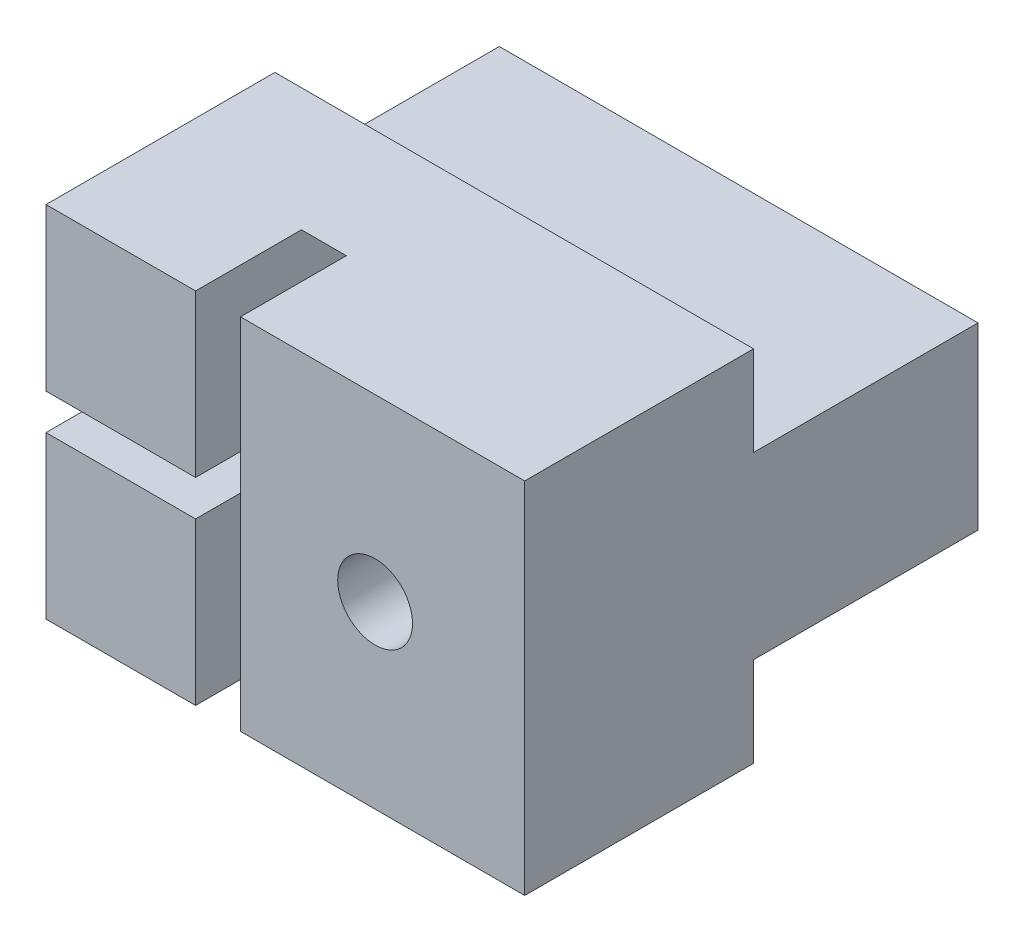
ISO-10303-21;
HEADER;
FILE_DESCRIPTION(('STEP AP214'),'2;1');
FILE_NAME('part.step','',(''),(''),'','','');
FILE_SCHEMA(('AUTOMOTIVE_DESIGN { 1 0 10303 214 1 1 1 1 }'));
ENDSEC;
DATA;
#1=APPLICATION_CONTEXT('core data for automotive mechanical design processes');
#2=APPLICATION_PROTOCOL_DEFINITION('international standard','automotive_design',2000,#1);
#3=PRODUCT_CONTEXT('',#1,'mechanical');
#4=PRODUCT('Part','Part','',(#3));
#5=PRODUCT_RELATED_PRODUCT_CATEGORY('part','',(#4));
#6=PRODUCT_DEFINITION_FORMATION('','',#4);
#7=PRODUCT_DEFINITION_CONTEXT('part definition',#1,'design');
#8=PRODUCT_DEFINITION('design','',#6,#7);
#9=PRODUCT_DEFINITION_SHAPE('','',#8);
#10=(LENGTH_UNIT() NAMED_UNIT(*) SI_UNIT(.MILLI.,.METRE.));
#11=(NAMED_UNIT(*) PLANE_ANGLE_UNIT() SI_UNIT($,.RADIAN.));
#12=(NAMED_UNIT(*) SI_UNIT($,.STERADIAN.) SOLID_ANGLE_UNIT());
#13=UNCERTAINTY_MEASURE_WITH_UNIT(LENGTH_MEASURE(1.E-05),#10,'distance_accuracy_value','');
#14=(GEOMETRIC_REPRESENTATION_CONTEXT(3) GLOBAL_UNCERTAINTY_ASSIGNED_CONTEXT((#13)) GLOBAL_UNIT_ASSIGNED_CONTEXT((#10,
#11,#12)) REPRESENTATION_CONTEXT('',''));
#15=CARTESIAN_POINT('',(0.,0.,0.));
#16=DIRECTION('',(0.,0.,1.));
#17=DIRECTION('',(1.,0.,0.));
#18=AXIS2_PLACEMENT_3D('',#15,#16,#17);
#19=CARTESIAN_POINT('',(0.,0.,0.));
#20=DIRECTION('',(0.,0.,-1.));
#21=DIRECTION('',(-1.,0.,0.));
#22=AXIS2_PLACEMENT_3D('',#19,#20,#21);
#23=PLANE('',#22);
#24=DIRECTION('',(1.,0.,0.));
#25=VECTOR('',#24,1.);
#26=CARTESIAN_POINT('',(-5.59969369608177,28.,0.));
#27=LINE('',#26,#25);
#28=CARTESIAN_POINT('',(-21.5996936960818,28.,0.));
#29=VERTEX_POINT('',#28);
#30=CARTESIAN_POINT('',(-5.59969369608177,28.,0.));
#31=VERTEX_POINT('',#30);
#32=EDGE_CURVE('E174',#29,#31,#27,.T.);
#33=ORIENTED_EDGE('',*,*,#32,.F.);
#34=DIRECTION('',(0.,-1.,0.));
#35=VECTOR('',#34,1.);
#36=CARTESIAN_POINT('',(-21.5996936960818,19.,0.));
#37=LINE('',#36,#35);
#38=CARTESIAN_POINT('',(-21.5996936960818,31.,0.));
#39=VERTEX_POINT('',#38);
#40=EDGE_CURVE('E245',#39,#29,#37,.T.);
#41=ORIENTED_EDGE('',*,*,#40,.F.);
#42=DIRECTION('',(-1.,0.,0.));
#43=VECTOR('',#42,1.);
#44=CARTESIAN_POINT('',(-21.5996936960818,31.,0.));
#45=LINE('',#44,#43);
#46=CARTESIAN_POINT('',(-5.59969369608177,31.,0.));
#47=VERTEX_POINT('',#46);
#48=EDGE_CURVE('E234',#47,#39,#45,.T.);
#49=ORIENTED_EDGE('',*,*,#48,.F.);
#50=DIRECTION('',(0.,1.,0.));
#51=VECTOR('',#50,1.);
#52=CARTESIAN_POINT('',(-5.59969369608177,19.,0.));
#53=LINE('',#52,#51);
#54=EDGE_CURVE('E56',#31,#47,#53,.T.);
#55=ORIENTED_EDGE('',*,*,#54,.F.);
#56=EDGE_LOOP('',(#33,#41,#49,#55));
#57=FACE_BOUND('',#56,.T.);
#58=ADVANCED_FACE('F41',(#57),#23,.T.);
#59=CARTESIAN_POINT('',(-21.5996936960818,19.,27.65));
#60=DIRECTION('',(0.,1.,0.));
#61=DIRECTION('',(0.,0.,1.));
#62=AXIS2_PLACEMENT_3D('',#59,#60,#61);
#63=PLANE('',#62);
#64=DIRECTION('',(0.,0.,1.));
#65=VECTOR('',#64,1.);
#66=CARTESIAN_POINT('',(-15.0996936960818,19.,27.65));
#67=LINE('',#66,#65);
#68=CARTESIAN_POINT('',(-15.0996936960818,19.,4.11123412892984));
#69=VERTEX_POINT('',#68);
#70=CARTESIAN_POINT('',(-15.0996936960818,19.,7.65));
#71=VERTEX_POINT('',#70);
#72=EDGE_CURVE('E201',#69,#71,#67,.T.);
#73=ORIENTED_EDGE('',*,*,#72,.F.);
#74=DIRECTION('',(-1.,0.,0.));
#75=VECTOR('',#74,1.);
#76=CARTESIAN_POINT('',(-15.0996936960818,19.,4.11123412892984));
#77=LINE('',#76,#75);
#78=CARTESIAN_POINT('',(-16.5996936960818,19.,4.11123412892984));
#79=VERTEX_POINT('',#78);
#80=EDGE_CURVE('E203',#69,#79,#77,.T.);
#81=ORIENTED_EDGE('',*,*,#80,.T.);
#82=DIRECTION('',(0.,0.,1.));
#83=VECTOR('',#82,1.);
#84=CARTESIAN_POINT('',(-16.5996936960818,19.,27.65));
#85=LINE('',#84,#83);
#86=CARTESIAN_POINT('',(-16.5996936960818,19.,7.65));
#87=VERTEX_POINT('',#86);
#88=EDGE_CURVE('E192',#79,#87,#85,.T.);
#89=ORIENTED_EDGE('',*,*,#88,.T.);
#90=DIRECTION('',(1.,0.,0.));
#91=VECTOR('',#90,1.);
#92=CARTESIAN_POINT('',(-21.5996936960818,19.,7.65));
#93=LINE('',#92,#91);
#94=CARTESIAN_POINT('',(-21.5996936960818,19.,7.65));
#95=VERTEX_POINT('',#94);
#96=EDGE_CURVE('E252',#95,#87,#93,.T.);
#97=ORIENTED_EDGE('',*,*,#96,.F.);
#98=DIRECTION('',(0.,0.,-1.));
#99=VECTOR('',#98,1.);
#100=CARTESIAN_POINT('',(-21.5996936960818,19.,27.65));
#101=LINE('',#100,#99);
#102=CARTESIAN_POINT('',(-21.5996936960818,19.,0.));
#103=VERTEX_POINT('',#102);
#104=EDGE_CURVE('E244',#95,#103,#101,.T.);
#105=ORIENTED_EDGE('',*,*,#104,.T.);
#106=DIRECTION('',(1.,0.,0.));
#107=VECTOR('',#106,1.);
#108=CARTESIAN_POINT('',(-21.5996936960818,19.,0.));
#109=LINE('',#108,#107);
#110=CARTESIAN_POINT('',(-5.59969369608177,19.,0.));
#111=VERTEX_POINT('',#110);
#112=EDGE_CURVE('E240',#103,#111,#109,.T.);
#113=ORIENTED_EDGE('',*,*,#112,.T.);
#114=DIRECTION('',(0.,0.,-1.));
#115=VECTOR('',#114,1.);
#116=CARTESIAN_POINT('',(-5.59969369608177,19.,27.65));
#117=LINE('',#116,#115);
#118=CARTESIAN_POINT('',(-5.59969369608177,19.,7.65));
#119=VERTEX_POINT('',#118);
#120=EDGE_CURVE('E243',#119,#111,#117,.T.);
#121=ORIENTED_EDGE('',*,*,#120,.F.);
#122=EDGE_CURVE('E255',#71,#119,#93,.T.);
#123=ORIENTED_EDGE('',*,*,#122,.F.);
#124=EDGE_LOOP('',(#73,#81,#89,#97,#105,#113,#121,#123));
#125=FACE_BOUND('',#124,.T.);
#126=ADVANCED_FACE('F278',(#125),#63,.F.);
#127=CARTESIAN_POINT('',(-21.5996936960818,31.,27.65));
#128=DIRECTION('',(0.,-1.,0.));
#129=DIRECTION('',(0.,0.,-1.));
#130=AXIS2_PLACEMENT_3D('',#127,#128,#129);
#131=PLANE('',#130);
#132=DIRECTION('',(0.,0.,-1.));
#133=VECTOR('',#132,1.);
#134=CARTESIAN_POINT('',(-15.0996936960818,31.,27.65));
#135=LINE('',#134,#133);
#136=CARTESIAN_POINT('',(-15.0996936960818,31.,7.65));
#137=VERTEX_POINT('',#136);
#138=CARTESIAN_POINT('',(-15.0996936960818,31.,4.11123412892984));
#139=VERTEX_POINT('',#138);
#140=EDGE_CURVE('E199',#137,#139,#135,.T.);
#141=ORIENTED_EDGE('',*,*,#140,.F.);
#142=DIRECTION('',(-1.,0.,0.));
#143=VECTOR('',#142,1.);
#144=CARTESIAN_POINT('',(-21.5996936960818,31.,7.65));
#145=LINE('',#144,#143);
#146=CARTESIAN_POINT('',(-5.59969369608177,31.,7.65));
#147=VERTEX_POINT('',#146);
#148=EDGE_CURVE('E260',#147,#137,#145,.T.);
#149=ORIENTED_EDGE('',*,*,#148,.F.);
#150=DIRECTION('',(0.,0.,-1.));
#151=VECTOR('',#150,1.);
#152=CARTESIAN_POINT('',(-5.59969369608177,31.,27.65));
#153=LINE('',#152,#151);
#154=EDGE_CURVE('E238',#147,#47,#153,.T.);
#155=ORIENTED_EDGE('',*,*,#154,.T.);
#156=ORIENTED_EDGE('',*,*,#48,.T.);
#157=DIRECTION('',(0.,0.,-1.));
#158=VECTOR('',#157,1.);
#159=CARTESIAN_POINT('',(-21.5996936960818,31.,27.65));
#160=LINE('',#159,#158);
#161=CARTESIAN_POINT('',(-21.5996936960818,31.,7.65));
#162=VERTEX_POINT('',#161);
#163=EDGE_CURVE('E227',#162,#39,#160,.T.);
#164=ORIENTED_EDGE('',*,*,#163,.F.);
#165=CARTESIAN_POINT('',(-16.5996936960818,31.,7.65));
#166=VERTEX_POINT('',#165);
#167=EDGE_CURVE('E237',#166,#162,#145,.T.);
#168=ORIENTED_EDGE('',*,*,#167,.F.);
#169=DIRECTION('',(0.,0.,-1.));
#170=VECTOR('',#169,1.);
#171=CARTESIAN_POINT('',(-16.5996936960818,31.,27.65));
#172=LINE('',#171,#170);
#173=CARTESIAN_POINT('',(-16.5996936960818,31.,4.11123412892984));
#174=VERTEX_POINT('',#173);
#175=EDGE_CURVE('E196',#166,#174,#172,.T.);
#176=ORIENTED_EDGE('',*,*,#175,.T.);
#177=DIRECTION('',(-1.,0.,0.));
#178=VECTOR('',#177,1.);
#179=CARTESIAN_POINT('',(-15.0996936960818,31.,4.11123412892984));
#180=LINE('',#179,#178);
#181=EDGE_CURVE('E11',#174,#139,#180,.F.);
#182=ORIENTED_EDGE('',*,*,#181,.T.);
#183=EDGE_LOOP('',(#141,#149,#155,#156,#164,#168,#176,#182));
#184=FACE_BOUND('',#183,.T.);
#185=ADVANCED_FACE('F281',(#184),#131,.F.);
#186=CARTESIAN_POINT('',(-94.7383382518,25.35,7.65));
#187=DIRECTION('',(0.,0.,1.));
#188=DIRECTION('',(0.,1.,0.));
#189=AXIS2_PLACEMENT_3D('',#186,#187,#188);
#190=PLANE('',#189);
#191=CARTESIAN_POINT('',(-10.5996936960818,25.,7.65));
#192=DIRECTION('',(0.,0.,-1.));
#193=DIRECTION('',(-1.,0.,0.));
#194=AXIS2_PLACEMENT_3D('',#191,#192,#193);
#195=CIRCLE('',#194,1.25);
#196=CARTESIAN_POINT('',(-11.8496936960818,25.,7.65));
#197=VERTEX_POINT('',#196);
#198=EDGE_CURVE('E365',#197,#197,#195,.T.);
#199=ORIENTED_EDGE('',*,*,#198,.T.);
#200=EDGE_LOOP('',(#199));
#201=FACE_BOUND('',#200,.T.);
#202=ORIENTED_EDGE('',*,*,#148,.T.);
#203=DIRECTION('',(0.,-1.,0.));
#204=VECTOR('',#203,1.);
#205=CARTESIAN_POINT('',(-15.0996936960818,25.35,7.65));
#206=LINE('',#205,#204);
#207=EDGE_CURVE('E49',#137,#71,#206,.T.);
#208=ORIENTED_EDGE('',*,*,#207,.T.);
#209=ORIENTED_EDGE('',*,*,#122,.T.);
#210=DIRECTION('',(0.,1.,0.));
#211=VECTOR('',#210,1.);
#212=CARTESIAN_POINT('',(-5.59969369608177,19.,7.65));
#213=LINE('',#212,#211);
#214=EDGE_CURVE('E249',#119,#147,#213,.T.);
#215=ORIENTED_EDGE('',*,*,#214,.T.);
#216=EDGE_LOOP('',(#202,#208,#209,#215));
#217=FACE_BOUND('',#216,.T.);
#218=ADVANCED_FACE('F271',(#201,#217),#190,.T.);
#219=DIRECTION('',(0.,-1.,0.));
#220=VECTOR('',#219,1.);
#221=CARTESIAN_POINT('',(-16.5996936960818,25.35,7.65));
#222=LINE('',#221,#220);
#223=CARTESIAN_POINT('',(-16.5996936960818,25.6,7.65));
#224=VERTEX_POINT('',#223);
#225=EDGE_CURVE('E193',#166,#224,#222,.T.);
#226=ORIENTED_EDGE('',*,*,#225,.F.);
#227=ORIENTED_EDGE('',*,*,#167,.T.);
#228=DIRECTION('',(0.,-1.,0.));
#229=VECTOR('',#228,1.);
#230=CARTESIAN_POINT('',(-21.5996936960818,19.,7.65));
#231=LINE('',#230,#229);
#232=CARTESIAN_POINT('',(-21.5996936960818,25.6,7.65));
#233=VERTEX_POINT('',#232);
#234=EDGE_CURVE('E256',#162,#233,#231,.T.);
#235=ORIENTED_EDGE('',*,*,#234,.T.);
#236=DIRECTION('',(-1.,0.,0.));
#237=VECTOR('',#236,1.);
#238=CARTESIAN_POINT('',(-21.5996936960818,25.6,7.65));
#239=LINE('',#238,#237);
#240=EDGE_CURVE('E211',#224,#233,#239,.T.);
#241=ORIENTED_EDGE('',*,*,#240,.F.);
#242=EDGE_LOOP('',(#226,#227,#235,#241));
#243=FACE_BOUND('',#242,.T.);
#244=ADVANCED_FACE('F316',(#243),#190,.T.);
#245=CARTESIAN_POINT('',(-21.5996936960818,19.,27.65));
#246=DIRECTION('',(1.,0.,0.));
#247=DIRECTION('',(0.,0.,-1.));
#248=AXIS2_PLACEMENT_3D('',#245,#246,#247);
#249=PLANE('',#248);
#250=DIRECTION('',(0.,-1.,0.));
#251=VECTOR('',#250,1.);
#252=CARTESIAN_POINT('',(-21.5996936960818,25.6,3.15));
#253=LINE('',#252,#251);
#254=CARTESIAN_POINT('',(-21.5996936960818,25.6,3.15));
#255=VERTEX_POINT('',#254);
#256=CARTESIAN_POINT('',(-21.5996936960818,24.4,3.15));
#257=VERTEX_POINT('',#256);
#258=EDGE_CURVE('E207',#255,#257,#253,.T.);
#259=ORIENTED_EDGE('',*,*,#258,.F.);
#260=DIRECTION('',(0.,0.,1.));
#261=VECTOR('',#260,1.);
#262=CARTESIAN_POINT('',(-21.5996936960818,25.6,3.15));
#263=LINE('',#262,#261);
#264=EDGE_CURVE('E224',#255,#233,#263,.T.);
#265=ORIENTED_EDGE('',*,*,#264,.T.);
#266=ORIENTED_EDGE('',*,*,#234,.F.);
#267=ORIENTED_EDGE('',*,*,#163,.T.);
#268=ORIENTED_EDGE('',*,*,#40,.T.);
#269=DIRECTION('',(0.,0.,1.));
#270=VECTOR('',#269,1.);
#271=CARTESIAN_POINT('',(-21.5996936960818,28.,-7.5));
#272=LINE('',#271,#270);
#273=CARTESIAN_POINT('',(-21.5996936960818,28.,-7.5));
#274=VERTEX_POINT('',#273);
#275=EDGE_CURVE('E184',#274,#29,#272,.T.);
#276=ORIENTED_EDGE('',*,*,#275,.F.);
#277=DIRECTION('',(0.,1.,0.));
#278=VECTOR('',#277,1.);
#279=CARTESIAN_POINT('',(-21.5996936960818,28.,-7.5));
#280=LINE('',#279,#278);
#281=CARTESIAN_POINT('',(-21.5996936960818,22.,-7.5));
#282=VERTEX_POINT('',#281);
#283=EDGE_CURVE('E164',#282,#274,#280,.T.);
#284=ORIENTED_EDGE('',*,*,#283,.F.);
#285=DIRECTION('',(0.,0.,1.));
#286=VECTOR('',#285,1.);
#287=CARTESIAN_POINT('',(-21.5996936960818,22.,-7.5));
#288=LINE('',#287,#286);
#289=CARTESIAN_POINT('',(-21.5996936960818,22.,0.));
#290=VERTEX_POINT('',#289);
#291=EDGE_CURVE('E161',#282,#290,#288,.T.);
#292=ORIENTED_EDGE('',*,*,#291,.T.);
#293=EDGE_CURVE('E248',#290,#103,#37,.T.);
#294=ORIENTED_EDGE('',*,*,#293,.T.);
#295=ORIENTED_EDGE('',*,*,#104,.F.);
#296=CARTESIAN_POINT('',(-21.5996936960818,24.4,7.65));
#297=VERTEX_POINT('',#296);
#298=EDGE_CURVE('E259',#297,#95,#231,.T.);
#299=ORIENTED_EDGE('',*,*,#298,.F.);
#300=DIRECTION('',(0.,0.,1.));
#301=VECTOR('',#300,1.);
#302=CARTESIAN_POINT('',(-21.5996936960818,24.4,3.15));
#303=LINE('',#302,#301);
#304=EDGE_CURVE('E220',#257,#297,#303,.T.);
#305=ORIENTED_EDGE('',*,*,#304,.F.);
#306=EDGE_LOOP('',(#259,#265,#266,#267,#268,#276,#284,#292,#294,#295,#299,#305));
#307=FACE_BOUND('',#306,.T.);
#308=ADVANCED_FACE('F297',(#307),#249,.F.);
#309=CARTESIAN_POINT('',(-5.59969369608177,19.,27.65));
#310=DIRECTION('',(-1.,0.,0.));
#311=DIRECTION('',(0.,0.,1.));
#312=AXIS2_PLACEMENT_3D('',#309,#310,#311);
#313=PLANE('',#312);
#314=ORIENTED_EDGE('',*,*,#214,.F.);
#315=ORIENTED_EDGE('',*,*,#120,.T.);
#316=CARTESIAN_POINT('',(-5.59969369608177,22.,0.));
#317=VERTEX_POINT('',#316);
#318=EDGE_CURVE('E178',#111,#317,#53,.T.);
#319=ORIENTED_EDGE('',*,*,#318,.T.);
#320=DIRECTION('',(0.,0.,1.));
#321=VECTOR('',#320,1.);
#322=CARTESIAN_POINT('',(-5.59969369608178,22.,-7.5));
#323=LINE('',#322,#321);
#324=CARTESIAN_POINT('',(-5.59969369608178,22.,-7.5));
#325=VERTEX_POINT('',#324);
#326=EDGE_CURVE('E159',#325,#317,#323,.T.);
#327=ORIENTED_EDGE('',*,*,#326,.F.);
#328=DIRECTION('',(0.,-1.,0.));
#329=VECTOR('',#328,1.);
#330=CARTESIAN_POINT('',(-5.59969369608177,28.,-7.5));
#331=LINE('',#330,#329);
#332=CARTESIAN_POINT('',(-5.59969369608177,28.,-7.5));
#333=VERTEX_POINT('',#332);
#334=EDGE_CURVE('E165',#333,#325,#331,.T.);
#335=ORIENTED_EDGE('',*,*,#334,.F.);
#336=DIRECTION('',(0.,0.,1.));
#337=VECTOR('',#336,1.);
#338=CARTESIAN_POINT('',(-5.59969369608177,28.,-7.5));
#339=LINE('',#338,#337);
#340=EDGE_CURVE('E304',#333,#31,#339,.T.);
#341=ORIENTED_EDGE('',*,*,#340,.T.);
#342=ORIENTED_EDGE('',*,*,#54,.T.);
#343=ORIENTED_EDGE('',*,*,#154,.F.);
#344=EDGE_LOOP('',(#314,#315,#319,#327,#335,#341,#342,#343));
#345=FACE_BOUND('',#344,.T.);
#346=ADVANCED_FACE('F177',(#345),#313,.F.);
#347=DIRECTION('',(-1.,0.,0.));
#348=VECTOR('',#347,1.);
#349=CARTESIAN_POINT('',(-5.59969369608178,22.,0.));
#350=LINE('',#349,#348);
#351=EDGE_CURVE('E64',#317,#290,#350,.T.);
#352=ORIENTED_EDGE('',*,*,#351,.F.);
#353=ORIENTED_EDGE('',*,*,#318,.F.);
#354=ORIENTED_EDGE('',*,*,#112,.F.);
#355=ORIENTED_EDGE('',*,*,#293,.F.);
#356=EDGE_LOOP('',(#352,#353,#354,#355));
#357=FACE_BOUND('',#356,.T.);
#358=ADVANCED_FACE('F298',(#357),#23,.T.);
#359=CARTESIAN_POINT('',(-16.5996936960818,24.4,7.65));
#360=VERTEX_POINT('',#359);
#361=EDGE_CURVE('E189',#360,#87,#222,.T.);
#362=ORIENTED_EDGE('',*,*,#361,.F.);
#363=DIRECTION('',(1.,0.,0.));
#364=VECTOR('',#363,1.);
#365=CARTESIAN_POINT('',(-21.5996936960818,24.4,7.65));
#366=LINE('',#365,#364);
#367=EDGE_CURVE('E206',#297,#360,#366,.T.);
#368=ORIENTED_EDGE('',*,*,#367,.F.);
#369=ORIENTED_EDGE('',*,*,#298,.T.);
#370=ORIENTED_EDGE('',*,*,#96,.T.);
#371=EDGE_LOOP('',(#362,#368,#369,#370));
#372=FACE_BOUND('',#371,.T.);
#373=ADVANCED_FACE('F43',(#372),#190,.T.);
#374=CARTESIAN_POINT('',(-21.5996936960818,25.6,3.15));
#375=DIRECTION('',(0.,1.,0.));
#376=DIRECTION('',(0.,0.,1.));
#377=AXIS2_PLACEMENT_3D('',#374,#375,#376);
#378=PLANE('',#377);
#379=ORIENTED_EDGE('',*,*,#240,.T.);
#380=ORIENTED_EDGE('',*,*,#264,.F.);
#381=DIRECTION('',(-1.,0.,0.));
#382=VECTOR('',#381,1.);
#383=CARTESIAN_POINT('',(-21.5996936960818,25.6,3.15));
#384=LINE('',#383,#382);
#385=CARTESIAN_POINT('',(-16.5996936960818,25.6,3.15));
#386=VERTEX_POINT('',#385);
#387=EDGE_CURVE('E217',#386,#255,#384,.T.);
#388=ORIENTED_EDGE('',*,*,#387,.F.);
#389=DIRECTION('',(0.,0.,1.));
#390=VECTOR('',#389,1.);
#391=CARTESIAN_POINT('',(-16.5996936960818,25.6,3.15));
#392=LINE('',#391,#390);
#393=EDGE_CURVE('E228',#386,#224,#392,.T.);
#394=ORIENTED_EDGE('',*,*,#393,.T.);
#395=EDGE_LOOP('',(#379,#380,#388,#394));
#396=FACE_BOUND('',#395,.T.);
#397=ADVANCED_FACE('F321',(#396),#378,.F.);
#398=CARTESIAN_POINT('',(-21.5996936960818,24.4,3.15));
#399=DIRECTION('',(0.,-1.,0.));
#400=DIRECTION('',(0.,0.,-1.));
#401=AXIS2_PLACEMENT_3D('',#398,#399,#400);
#402=PLANE('',#401);
#403=ORIENTED_EDGE('',*,*,#367,.T.);
#404=DIRECTION('',(0.,0.,1.));
#405=VECTOR('',#404,1.);
#406=CARTESIAN_POINT('',(-16.5996936960818,24.4,3.15));
#407=LINE('',#406,#405);
#408=CARTESIAN_POINT('',(-16.5996936960818,24.4,3.15));
#409=VERTEX_POINT('',#408);
#410=EDGE_CURVE('E231',#409,#360,#407,.T.);
#411=ORIENTED_EDGE('',*,*,#410,.F.);
#412=DIRECTION('',(1.,0.,0.));
#413=VECTOR('',#412,1.);
#414=CARTESIAN_POINT('',(-21.5996936960818,24.4,3.15));
#415=LINE('',#414,#413);
#416=EDGE_CURVE('E210',#257,#409,#415,.T.);
#417=ORIENTED_EDGE('',*,*,#416,.F.);
#418=ORIENTED_EDGE('',*,*,#304,.T.);
#419=EDGE_LOOP('',(#403,#411,#417,#418));
#420=FACE_BOUND('',#419,.T.);
#421=ADVANCED_FACE('F326',(#420),#402,.F.);
#422=CARTESIAN_POINT('',(0.,0.,3.15));
#423=DIRECTION('',(0.,0.,1.));
#424=DIRECTION('',(1.,0.,0.));
#425=AXIS2_PLACEMENT_3D('',#422,#423,#424);
#426=PLANE('',#425);
#427=ORIENTED_EDGE('',*,*,#258,.T.);
#428=ORIENTED_EDGE('',*,*,#416,.T.);
#429=DIRECTION('',(0.,1.,0.));
#430=VECTOR('',#429,1.);
#431=CARTESIAN_POINT('',(-16.5996936960818,25.6,3.15));
#432=LINE('',#431,#430);
#433=EDGE_CURVE('E214',#409,#386,#432,.T.);
#434=ORIENTED_EDGE('',*,*,#433,.T.);
#435=ORIENTED_EDGE('',*,*,#387,.T.);
#436=EDGE_LOOP('',(#427,#428,#434,#435));
#437=FACE_BOUND('',#436,.T.);
#438=ADVANCED_FACE('F323',(#437),#426,.T.);
#439=CARTESIAN_POINT('',(-15.0996936960818,25.,8.));
#440=DIRECTION('',(-1.,0.,0.));
#441=DIRECTION('',(0.,0.,1.));
#442=AXIS2_PLACEMENT_3D('',#439,#440,#441);
#443=CYLINDRICAL_SURFACE('',#442,7.15);
#444=CARTESIAN_POINT('',(-15.0996936960818,25.,8.));
#445=DIRECTION('',(-1.,0.,0.));
#446=DIRECTION('',(0.,0.,1.));
#447=AXIS2_PLACEMENT_3D('',#444,#445,#446);
#448=CIRCLE('',#447,7.15);
#449=EDGE_CURVE('E182',#139,#69,#448,.T.);
#450=ORIENTED_EDGE('',*,*,#449,.F.);
#451=ORIENTED_EDGE('',*,*,#181,.F.);
#452=CARTESIAN_POINT('',(-16.5996936960818,25.,8.));
#453=DIRECTION('',(-1.,0.,0.));
#454=DIRECTION('',(0.,0.,1.));
#455=AXIS2_PLACEMENT_3D('',#452,#453,#454);
#456=CIRCLE('',#455,7.15);
#457=EDGE_CURVE('E179',#174,#79,#456,.T.);
#458=ORIENTED_EDGE('',*,*,#457,.T.);
#459=ORIENTED_EDGE('',*,*,#80,.F.);
#460=EDGE_LOOP('',(#450,#451,#458,#459));
#461=FACE_BOUND('',#460,.T.);
#462=ADVANCED_FACE('F285',(#461),#443,.F.);
#463=CARTESIAN_POINT('',(-15.0996936960818,25.,8.));
#464=DIRECTION('',(-1.,0.,0.));
#465=DIRECTION('',(0.,0.,1.));
#466=AXIS2_PLACEMENT_3D('',#463,#464,#465);
#467=PLANE('',#466);
#468=ORIENTED_EDGE('',*,*,#72,.T.);
#469=ORIENTED_EDGE('',*,*,#207,.F.);
#470=ORIENTED_EDGE('',*,*,#140,.T.);
#471=ORIENTED_EDGE('',*,*,#449,.T.);
#472=EDGE_LOOP('',(#468,#469,#470,#471));
#473=FACE_BOUND('',#472,.T.);
#474=ADVANCED_FACE('F283',(#473),#467,.T.);
#475=CARTESIAN_POINT('',(-16.5996936960818,25.,8.));
#476=DIRECTION('',(-1.,0.,0.));
#477=DIRECTION('',(0.,0.,1.));
#478=AXIS2_PLACEMENT_3D('',#475,#476,#477);
#479=PLANE('',#478);
#480=ORIENTED_EDGE('',*,*,#225,.T.);
#481=ORIENTED_EDGE('',*,*,#393,.F.);
#482=ORIENTED_EDGE('',*,*,#433,.F.);
#483=ORIENTED_EDGE('',*,*,#410,.T.);
#484=ORIENTED_EDGE('',*,*,#361,.T.);
#485=ORIENTED_EDGE('',*,*,#88,.F.);
#486=ORIENTED_EDGE('',*,*,#457,.F.);
#487=ORIENTED_EDGE('',*,*,#175,.F.);
#488=EDGE_LOOP('',(#480,#481,#482,#483,#484,#485,#486,#487));
#489=FACE_BOUND('',#488,.T.);
#490=ADVANCED_FACE('F318',(#489),#479,.F.);
#491=CARTESIAN_POINT('',(-5.59969369608178,22.,-7.5));
#492=DIRECTION('',(0.,1.,0.));
#493=DIRECTION('',(0.,0.,1.));
#494=AXIS2_PLACEMENT_3D('',#491,#492,#493);
#495=PLANE('',#494);
#496=ORIENTED_EDGE('',*,*,#351,.T.);
#497=ORIENTED_EDGE('',*,*,#291,.F.);
#498=DIRECTION('',(-1.,0.,0.));
#499=VECTOR('',#498,1.);
#500=CARTESIAN_POINT('',(-5.59969369608178,22.,-7.5));
#501=LINE('',#500,#499);
#502=EDGE_CURVE('E155',#325,#282,#501,.T.);
#503=ORIENTED_EDGE('',*,*,#502,.F.);
#504=ORIENTED_EDGE('',*,*,#326,.T.);
#505=EDGE_LOOP('',(#496,#497,#503,#504));
#506=FACE_BOUND('',#505,.T.);
#507=ADVANCED_FACE('F157',(#506),#495,.F.);
#508=CARTESIAN_POINT('',(-5.59969369608177,28.,-7.5));
#509=DIRECTION('',(0.,-1.,0.));
#510=DIRECTION('',(0.,0.,-1.));
#511=AXIS2_PLACEMENT_3D('',#508,#509,#510);
#512=PLANE('',#511);
#513=ORIENTED_EDGE('',*,*,#32,.T.);
#514=ORIENTED_EDGE('',*,*,#340,.F.);
#515=DIRECTION('',(1.,0.,0.));
#516=VECTOR('',#515,1.);
#517=CARTESIAN_POINT('',(-5.59969369608177,28.,-7.5));
#518=LINE('',#517,#516);
#519=EDGE_CURVE('E170',#274,#333,#518,.T.);
#520=ORIENTED_EDGE('',*,*,#519,.F.);
#521=ORIENTED_EDGE('',*,*,#275,.T.);
#522=EDGE_LOOP('',(#513,#514,#520,#521));
#523=FACE_BOUND('',#522,.T.);
#524=ADVANCED_FACE('F309',(#523),#512,.F.);
#525=CARTESIAN_POINT('',(0.,0.,-7.5));
#526=DIRECTION('',(0.,0.,-1.));
#527=DIRECTION('',(-1.,0.,0.));
#528=AXIS2_PLACEMENT_3D('',#525,#526,#527);
#529=PLANE('',#528);
#530=CARTESIAN_POINT('',(-10.5996936960818,25.,-7.5));
#531=DIRECTION('',(0.,0.,-1.));
#532=DIRECTION('',(-1.,0.,0.));
#533=AXIS2_PLACEMENT_3D('',#530,#531,#532);
#534=CIRCLE('',#533,2.25);
#535=CARTESIAN_POINT('',(-12.8496936960818,25.,-7.5));
#536=VERTEX_POINT('',#535);
#537=EDGE_CURVE('E367',#536,#536,#534,.T.);
#538=ORIENTED_EDGE('',*,*,#537,.F.);
#539=EDGE_LOOP('',(#538));
#540=FACE_BOUND('',#539,.T.);
#541=ORIENTED_EDGE('',*,*,#334,.T.);
#542=ORIENTED_EDGE('',*,*,#502,.T.);
#543=ORIENTED_EDGE('',*,*,#283,.T.);
#544=ORIENTED_EDGE('',*,*,#519,.T.);
#545=EDGE_LOOP('',(#541,#542,#543,#544));
#546=FACE_BOUND('',#545,.T.);
#547=ADVANCED_FACE('F168',(#540,#546),#529,.T.);
#548=CARTESIAN_POINT('',(-10.5996936960818,25.,6.36396103067893));
#549=DIRECTION('',(0.,0.,-1.));
#550=DIRECTION('',(-1.,0.,0.));
#551=AXIS2_PLACEMENT_3D('',#548,#549,#550);
#552=CYLINDRICAL_SURFACE('',#551,2.25);
#553=CARTESIAN_POINT('',(-10.5996936960818,25.,0.));
#554=DIRECTION('',(0.,0.,-1.));
#555=DIRECTION('',(-1.,0.,0.));
#556=AXIS2_PLACEMENT_3D('',#553,#554,#555);
#557=CIRCLE('',#556,2.25);
#558=CARTESIAN_POINT('',(-12.8496936960818,25.,0.));
#559=VERTEX_POINT('',#558);
#560=EDGE_CURVE('E299',#559,#559,#557,.F.);
#561=ORIENTED_EDGE('',*,*,#560,.T.);
#562=EDGE_LOOP('',(#561));
#563=FACE_BOUND('',#562,.T.);
#564=ORIENTED_EDGE('',*,*,#537,.T.);
#565=EDGE_LOOP('',(#564));
#566=FACE_BOUND('',#565,.T.);
#567=ADVANCED_FACE('F378',(#563,#566),#552,.F.);
#568=CARTESIAN_POINT('',(0.,0.,0.));
#569=DIRECTION('',(0.,0.,-1.));
#570=DIRECTION('',(-1.,0.,0.));
#571=AXIS2_PLACEMENT_3D('',#568,#569,#570);
#572=PLANE('',#571);
#573=CARTESIAN_POINT('',(-10.5996936960818,25.,0.));
#574=DIRECTION('',(0.,0.,-1.));
#575=DIRECTION('',(-1.,0.,0.));
#576=AXIS2_PLACEMENT_3D('',#573,#574,#575);
#577=CIRCLE('',#576,1.25);
#578=CARTESIAN_POINT('',(-11.8496936960818,25.,0.));
#579=VERTEX_POINT('',#578);
#580=EDGE_CURVE('E368',#579,#579,#577,.T.);
#581=ORIENTED_EDGE('',*,*,#580,.F.);
#582=EDGE_LOOP('',(#581));
#583=FACE_BOUND('',#582,.T.);
#584=ORIENTED_EDGE('',*,*,#560,.F.);
#585=EDGE_LOOP('',(#584));
#586=FACE_BOUND('',#585,.T.);
#587=ADVANCED_FACE('F381',(#583,#586),#572,.T.);
#588=CARTESIAN_POINT('',(-10.5996936960818,25.,7.65));
#589=DIRECTION('',(0.,0.,-1.));
#590=DIRECTION('',(-1.,0.,0.));
#591=AXIS2_PLACEMENT_3D('',#588,#589,#590);
#592=CYLINDRICAL_SURFACE('',#591,1.25);
#593=ORIENTED_EDGE('',*,*,#198,.F.);
#594=EDGE_LOOP('',(#593));
#595=FACE_BOUND('',#594,.T.);
#596=ORIENTED_EDGE('',*,*,#580,.T.);
#597=EDGE_LOOP('',(#596));
#598=FACE_BOUND('',#597,.T.);
#599=ADVANCED_FACE('F382',(#595,#598),#592,.F.);
#600=CLOSED_SHELL('',(#58,#126,#185,#218,#244,#308,#346,#358,#373,#397,#421,#438,#462,#474,#490,
#507,#524,#547,#567,#587,#599));
#601=MANIFOLD_SOLID_BREP('B2',#600);
#602=ADVANCED_BREP_SHAPE_REPRESENTATION('',(#18,#601),#14);
#603=SHAPE_DEFINITION_REPRESENTATION(#9,#602);
ENDSEC;
END-ISO-10303-21;
